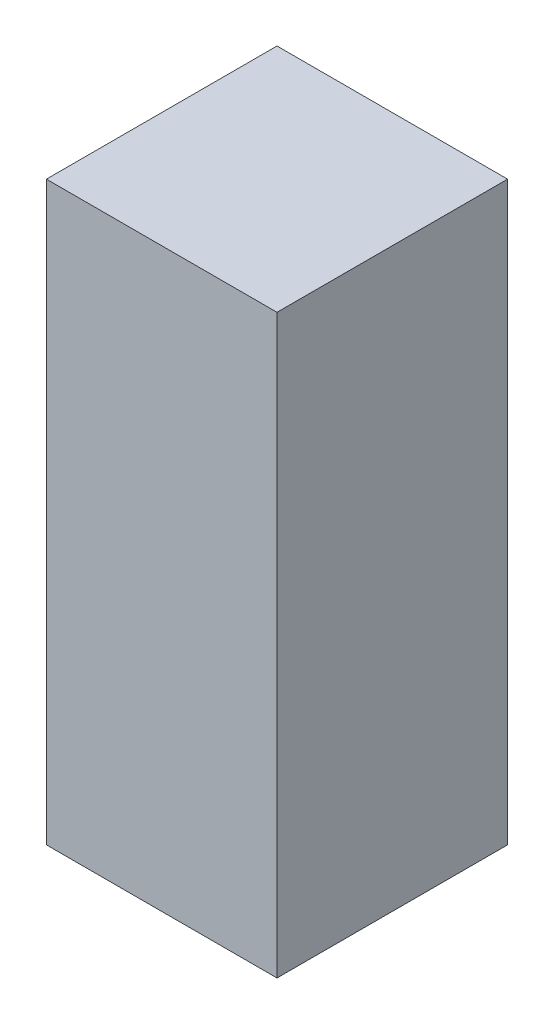
ISO-10303-21;
HEADER;
FILE_DESCRIPTION(('STEP AP214'),'2;1');
FILE_NAME('part.step','',(''),(''),'','','');
FILE_SCHEMA(('AUTOMOTIVE_DESIGN { 1 0 10303 214 1 1 1 1 }'));
ENDSEC;
DATA;
#1=APPLICATION_CONTEXT('core data for automotive mechanical design processes');
#2=APPLICATION_PROTOCOL_DEFINITION('international standard','automotive_design',2000,#1);
#3=PRODUCT_CONTEXT('',#1,'mechanical');
#4=PRODUCT('Part','Part','',(#3));
#5=PRODUCT_RELATED_PRODUCT_CATEGORY('part','',(#4));
#6=PRODUCT_DEFINITION_FORMATION('','',#4);
#7=PRODUCT_DEFINITION_CONTEXT('part definition',#1,'design');
#8=PRODUCT_DEFINITION('design','',#6,#7);
#9=PRODUCT_DEFINITION_SHAPE('','',#8);
#10=(LENGTH_UNIT() NAMED_UNIT(*) SI_UNIT(.MILLI.,.METRE.));
#11=(NAMED_UNIT(*) PLANE_ANGLE_UNIT() SI_UNIT($,.RADIAN.));
#12=(NAMED_UNIT(*) SI_UNIT($,.STERADIAN.) SOLID_ANGLE_UNIT());
#13=UNCERTAINTY_MEASURE_WITH_UNIT(LENGTH_MEASURE(1.E-05),#10,'distance_accuracy_value','');
#14=(GEOMETRIC_REPRESENTATION_CONTEXT(3) GLOBAL_UNCERTAINTY_ASSIGNED_CONTEXT((#13)) GLOBAL_UNIT_ASSIGNED_CONTEXT((#10,
#11,#12)) REPRESENTATION_CONTEXT('',''));
#15=CARTESIAN_POINT('',(0.,0.,0.));
#16=DIRECTION('',(0.,0.,1.));
#17=DIRECTION('',(1.,0.,0.));
#18=AXIS2_PLACEMENT_3D('',#15,#16,#17);
#19=CARTESIAN_POINT('',(0.,10.,-4.));
#20=DIRECTION('',(1.,0.,0.));
#21=DIRECTION('',(0.,0.,-1.));
#22=AXIS2_PLACEMENT_3D('',#19,#20,#21);
#23=PLANE('',#22);
#24=DIRECTION('',(0.,0.,1.));
#25=VECTOR('',#24,1.);
#26=CARTESIAN_POINT('',(0.,0.,-4.));
#27=LINE('',#26,#25);
#28=CARTESIAN_POINT('',(0.,0.,-4.));
#29=VERTEX_POINT('',#28);
#30=CARTESIAN_POINT('',(0.,0.,0.));
#31=VERTEX_POINT('',#30);
#32=EDGE_CURVE('E111',#29,#31,#27,.T.);
#33=ORIENTED_EDGE('',*,*,#32,.T.);
#34=DIRECTION('',(0.,-1.,0.));
#35=VECTOR('',#34,1.);
#36=CARTESIAN_POINT('',(0.,10.,0.));
#37=LINE('',#36,#35);
#38=CARTESIAN_POINT('',(0.,10.,0.));
#39=VERTEX_POINT('',#38);
#40=EDGE_CURVE('E11',#39,#31,#37,.T.);
#41=ORIENTED_EDGE('',*,*,#40,.F.);
#42=DIRECTION('',(0.,0.,1.));
#43=VECTOR('',#42,1.);
#44=CARTESIAN_POINT('',(0.,10.,-4.));
#45=LINE('',#44,#43);
#46=CARTESIAN_POINT('',(0.,10.,-4.));
#47=VERTEX_POINT('',#46);
#48=EDGE_CURVE('E95',#47,#39,#45,.T.);
#49=ORIENTED_EDGE('',*,*,#48,.F.);
#50=DIRECTION('',(0.,-1.,0.));
#51=VECTOR('',#50,1.);
#52=CARTESIAN_POINT('',(0.,10.,-4.));
#53=LINE('',#52,#51);
#54=EDGE_CURVE('E107',#47,#29,#53,.T.);
#55=ORIENTED_EDGE('',*,*,#54,.T.);
#56=EDGE_LOOP('',(#33,#41,#49,#55));
#57=FACE_BOUND('',#56,.T.);
#58=ADVANCED_FACE('F43',(#57),#23,.F.);
#59=CARTESIAN_POINT('',(0.,10.,0.));
#60=DIRECTION('',(0.,0.,-1.));
#61=DIRECTION('',(-1.,0.,0.));
#62=AXIS2_PLACEMENT_3D('',#59,#60,#61);
#63=PLANE('',#62);
#64=DIRECTION('',(1.,0.,0.));
#65=VECTOR('',#64,1.);
#66=CARTESIAN_POINT('',(0.,0.,0.));
#67=LINE('',#66,#65);
#68=CARTESIAN_POINT('',(4.,0.,0.));
#69=VERTEX_POINT('',#68);
#70=EDGE_CURVE('E100',#31,#69,#67,.T.);
#71=ORIENTED_EDGE('',*,*,#70,.T.);
#72=DIRECTION('',(0.,-1.,0.));
#73=VECTOR('',#72,1.);
#74=CARTESIAN_POINT('',(4.,10.,0.));
#75=LINE('',#74,#73);
#76=CARTESIAN_POINT('',(4.,10.,0.));
#77=VERTEX_POINT('',#76);
#78=EDGE_CURVE('E52',#77,#69,#75,.T.);
#79=ORIENTED_EDGE('',*,*,#78,.F.);
#80=DIRECTION('',(1.,0.,0.));
#81=VECTOR('',#80,1.);
#82=CARTESIAN_POINT('',(0.,10.,0.));
#83=LINE('',#82,#81);
#84=EDGE_CURVE('E90',#39,#77,#83,.T.);
#85=ORIENTED_EDGE('',*,*,#84,.F.);
#86=ORIENTED_EDGE('',*,*,#40,.T.);
#87=EDGE_LOOP('',(#71,#79,#85,#86));
#88=FACE_BOUND('',#87,.T.);
#89=ADVANCED_FACE('F99',(#88),#63,.F.);
#90=CARTESIAN_POINT('',(4.,10.,-4.));
#91=DIRECTION('',(-1.,0.,0.));
#92=DIRECTION('',(0.,0.,1.));
#93=AXIS2_PLACEMENT_3D('',#90,#91,#92);
#94=PLANE('',#93);
#95=DIRECTION('',(0.,0.,-1.));
#96=VECTOR('',#95,1.);
#97=CARTESIAN_POINT('',(4.,0.,-4.));
#98=LINE('',#97,#96);
#99=CARTESIAN_POINT('',(4.,0.,-4.));
#100=VERTEX_POINT('',#99);
#101=EDGE_CURVE('E77',#69,#100,#98,.T.);
#102=ORIENTED_EDGE('',*,*,#101,.T.);
#103=DIRECTION('',(0.,-1.,0.));
#104=VECTOR('',#103,1.);
#105=CARTESIAN_POINT('',(4.,10.,-4.));
#106=LINE('',#105,#104);
#107=CARTESIAN_POINT('',(4.,10.,-4.));
#108=VERTEX_POINT('',#107);
#109=EDGE_CURVE('E102',#108,#100,#106,.T.);
#110=ORIENTED_EDGE('',*,*,#109,.F.);
#111=DIRECTION('',(0.,0.,-1.));
#112=VECTOR('',#111,1.);
#113=CARTESIAN_POINT('',(4.,10.,-4.));
#114=LINE('',#113,#112);
#115=EDGE_CURVE('E93',#77,#108,#114,.T.);
#116=ORIENTED_EDGE('',*,*,#115,.F.);
#117=ORIENTED_EDGE('',*,*,#78,.T.);
#118=EDGE_LOOP('',(#102,#110,#116,#117));
#119=FACE_BOUND('',#118,.T.);
#120=ADVANCED_FACE('F103',(#119),#94,.F.);
#121=CARTESIAN_POINT('',(0.,10.,-4.));
#122=DIRECTION('',(0.,0.,1.));
#123=DIRECTION('',(1.,0.,0.));
#124=AXIS2_PLACEMENT_3D('',#121,#122,#123);
#125=PLANE('',#124);
#126=DIRECTION('',(-1.,0.,0.));
#127=VECTOR('',#126,1.);
#128=CARTESIAN_POINT('',(0.,0.,-4.));
#129=LINE('',#128,#127);
#130=EDGE_CURVE('E83',#100,#29,#129,.T.);
#131=ORIENTED_EDGE('',*,*,#130,.T.);
#132=ORIENTED_EDGE('',*,*,#54,.F.);
#133=DIRECTION('',(-1.,0.,0.));
#134=VECTOR('',#133,1.);
#135=CARTESIAN_POINT('',(0.,10.,-4.));
#136=LINE('',#135,#134);
#137=EDGE_CURVE('E60',#108,#47,#136,.T.);
#138=ORIENTED_EDGE('',*,*,#137,.F.);
#139=ORIENTED_EDGE('',*,*,#109,.T.);
#140=EDGE_LOOP('',(#131,#132,#138,#139));
#141=FACE_BOUND('',#140,.T.);
#142=ADVANCED_FACE('F124',(#141),#125,.F.);
#143=CARTESIAN_POINT('',(0.,10.,0.));
#144=DIRECTION('',(0.,1.,0.));
#145=DIRECTION('',(0.,0.,1.));
#146=AXIS2_PLACEMENT_3D('',#143,#144,#145);
#147=PLANE('',#146);
#148=ORIENTED_EDGE('',*,*,#48,.T.);
#149=ORIENTED_EDGE('',*,*,#84,.T.);
#150=ORIENTED_EDGE('',*,*,#115,.T.);
#151=ORIENTED_EDGE('',*,*,#137,.T.);
#152=EDGE_LOOP('',(#148,#149,#150,#151));
#153=FACE_BOUND('',#152,.T.);
#154=ADVANCED_FACE('F91',(#153),#147,.T.);
#155=CARTESIAN_POINT('',(0.,0.,0.));
#156=DIRECTION('',(0.,1.,0.));
#157=DIRECTION('',(0.,0.,1.));
#158=AXIS2_PLACEMENT_3D('',#155,#156,#157);
#159=PLANE('',#158);
#160=ORIENTED_EDGE('',*,*,#32,.F.);
#161=ORIENTED_EDGE('',*,*,#130,.F.);
#162=ORIENTED_EDGE('',*,*,#101,.F.);
#163=ORIENTED_EDGE('',*,*,#70,.F.);
#164=EDGE_LOOP('',(#160,#161,#162,#163));
#165=FACE_BOUND('',#164,.T.);
#166=ADVANCED_FACE('F127',(#165),#159,.F.);
#167=CLOSED_SHELL('',(#58,#89,#120,#142,#154,#166));
#168=MANIFOLD_SOLID_BREP('B2',#167);
#169=ADVANCED_BREP_SHAPE_REPRESENTATION('',(#18,#168),#14);
#170=SHAPE_DEFINITION_REPRESENTATION(#9,#169);
ENDSEC;
END-ISO-10303-21;
